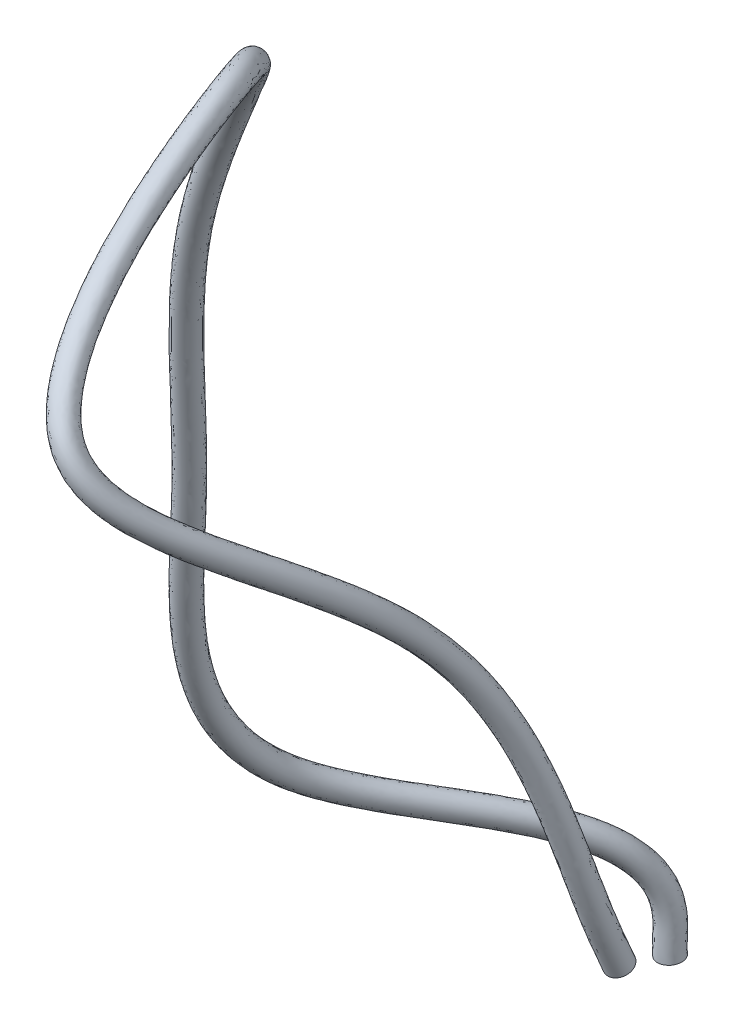
ISO-10303-21;
HEADER;
FILE_DESCRIPTION(('STEP AP214'),'2;1');
FILE_NAME('part.step','',(''),(''),'','','');
FILE_SCHEMA(('AUTOMOTIVE_DESIGN { 1 0 10303 214 1 1 1 1 }'));
ENDSEC;
DATA;
#1=APPLICATION_CONTEXT('core data for automotive mechanical design processes');
#2=APPLICATION_PROTOCOL_DEFINITION('international standard','automotive_design',2000,#1);
#3=PRODUCT_CONTEXT('',#1,'mechanical');
#4=PRODUCT('Part','Part','',(#3));
#5=PRODUCT_RELATED_PRODUCT_CATEGORY('part','',(#4));
#6=PRODUCT_DEFINITION_FORMATION('','',#4);
#7=PRODUCT_DEFINITION_CONTEXT('part definition',#1,'design');
#8=PRODUCT_DEFINITION('design','',#6,#7);
#9=PRODUCT_DEFINITION_SHAPE('','',#8);
#10=(LENGTH_UNIT() NAMED_UNIT(*) SI_UNIT(.MILLI.,.METRE.));
#11=(NAMED_UNIT(*) PLANE_ANGLE_UNIT() SI_UNIT($,.RADIAN.));
#12=(NAMED_UNIT(*) SI_UNIT($,.STERADIAN.) SOLID_ANGLE_UNIT());
#13=UNCERTAINTY_MEASURE_WITH_UNIT(LENGTH_MEASURE(1.E-05),#10,'distance_accuracy_value','');
#14=(GEOMETRIC_REPRESENTATION_CONTEXT(3) GLOBAL_UNCERTAINTY_ASSIGNED_CONTEXT((#13)) GLOBAL_UNIT_ASSIGNED_CONTEXT((#10,
#11,#12)) REPRESENTATION_CONTEXT('',''));
#15=CARTESIAN_POINT('',(0.,0.,0.));
#16=DIRECTION('',(0.,0.,1.));
#17=DIRECTION('',(1.,0.,0.));
#18=AXIS2_PLACEMENT_3D('',#15,#16,#17);
#19=CARTESIAN_POINT('',(1.75,4.81801421890762,-4.75));
#20=DIRECTION('',(-0.0325020887268541,0.998426582921054,0.0456943404042556));
#21=DIRECTION('',(0.,-0.045718494968868,0.99895436293045));
#22=AXIS2_PLACEMENT_3D('',#19,#20,#21);
#23=PLANE('',#22);
#24=CARTESIAN_POINT('',(1.75,4.81801421890762,-4.75));
#25=DIRECTION('',(-0.0325020887268541,0.998426582921054,0.0456943404042556));
#26=DIRECTION('',(0.,-0.045718494968868,0.99895436293045));
#27=AXIS2_PLACEMENT_3D('',#24,#25,#26);
#28=CIRCLE('',#27,0.375);
#29=CARTESIAN_POINT('',(1.75,4.80086978329429,-4.37539211390108));
#30=VERTEX_POINT('',#29);
#31=EDGE_CURVE('E46',#30,#30,#28,.T.);
#32=ORIENTED_EDGE('',*,*,#31,.F.);
#33=EDGE_LOOP('',(#32));
#34=FACE_BOUND('',#33,.T.);
#35=ADVANCED_FACE('F39',(#34),#23,.F.);
#36=CARTESIAN_POINT('',(14.45,18.0575045512539,9.49942929571113));
#37=DIRECTION('',(0.00593618221666124,-0.922706611834414,-0.385457222292886));
#38=DIRECTION('',(-0.944224740760021,0.121743546679703,-0.305970828312954));
#39=AXIS2_PLACEMENT_3D('',#36,#37,#38);
#40=PLANE('',#39);
#41=CARTESIAN_POINT('',(14.45,18.0575045512539,9.49942929571113));
#42=DIRECTION('',(0.00593618221666124,-0.922706611834414,-0.385457222292886));
#43=DIRECTION('',(-0.944224740760021,0.121743546679703,-0.305970828312954));
#44=AXIS2_PLACEMENT_3D('',#41,#42,#43);
#45=CIRCLE('',#44,0.375);
#46=CARTESIAN_POINT('',(14.095915722215,18.1031583812588,9.38469023509377));
#47=VERTEX_POINT('',#46);
#48=EDGE_CURVE('E12',#47,#47,#45,.T.);
#49=ORIENTED_EDGE('',*,*,#48,.T.);
#50=EDGE_LOOP('',(#49));
#51=FACE_BOUND('',#50,.T.);
#52=ADVANCED_FACE('F53',(#51),#40,.T.);
#53=CARTESIAN_POINT('',(1.75,4.80086978329429,-4.37539211390108));
#54=CARTESIAN_POINT('',(1.73834549138408,5.15888477657701,-4.35900716435525));
#55=CARTESIAN_POINT('',(1.75858560857531,5.51339195407523,-4.38854768858719));
#56=CARTESIAN_POINT('',(1.74031176664539,6.16025100675149,-4.35894673934592));
#57=CARTESIAN_POINT('',(1.6878111012617,6.46481684548407,-4.28283425630049));
#58=CARTESIAN_POINT('',(1.51459229823426,7.01539495219556,-4.0301336434056));
#59=CARTESIAN_POINT('',(1.39248305121336,7.26200733868386,-3.85164046028846));
#60=CARTESIAN_POINT('',(0.935927077086803,7.94369272802451,-3.17282927306072));
#61=CARTESIAN_POINT('',(0.522242189846164,8.32292801140119,-2.52508126861568));
#62=CARTESIAN_POINT('',(-0.427874231001778,8.97406507712691,-1.07153849457391));
#63=CARTESIAN_POINT('',(-0.940339246713123,9.26528804569354,-0.261981524505833));
#64=CARTESIAN_POINT('',(-1.87106404941776,9.93667117577498,1.31751262818178));
#65=CARTESIAN_POINT('',(-2.29026422925484,10.3161228840242,2.08830559018309));
#66=CARTESIAN_POINT('',(-2.86564913549272,11.349607496572,3.39521388898401));
#67=CARTESIAN_POINT('',(-3.01375331122337,11.9950088881717,3.91565164964581));
#68=CARTESIAN_POINT('',(-3.1123987189796,13.444399837937,4.75125041499851));
#69=CARTESIAN_POINT('',(-3.0638995121567,14.2481789852778,5.0676585370757));
#70=CARTESIAN_POINT('',(-2.75414927828088,16.777189774041,5.82754846007048));
#71=CARTESIAN_POINT('',(-2.32893654328877,18.6235112799891,6.08366366957657));
#72=CARTESIAN_POINT('',(-1.36117551425449,23.7297998263982,6.94382870020401));
#73=CARTESIAN_POINT('',(-1.11285174562104,26.6047510072162,7.64115992546083));
#74=CARTESIAN_POINT('',(0.438450670251853,30.7242292579583,8.33100387890877));
#75=CARTESIAN_POINT('',(0.808789455132816,31.569006402865,8.4591098466644));
#76=CARTESIAN_POINT('',(1.41231139758344,32.7884491422252,8.69732595118506));
#77=CARTESIAN_POINT('',(1.62409724059286,33.1858047161594,8.78305994849925));
#78=CARTESIAN_POINT('',(2.04420088839937,33.9561428932773,8.98550560214589));
#79=CARTESIAN_POINT('',(2.24353095760551,34.3333071091578,9.10615816499072));
#80=CARTESIAN_POINT('',(3.2757019866038,36.0997636126222,9.77386393543771));
#81=CARTESIAN_POINT('',(4.13427932199285,37.1302826934259,10.5431744798521));
#82=CARTESIAN_POINT('',(5.15645090556548,37.6539821305996,12.5383843190243));
#83=CARTESIAN_POINT('',(5.47630747135298,37.6570117499277,13.3749309830197));
#84=CARTESIAN_POINT('',(6.0634821269365,37.3969355964973,15.1506546846571));
#85=CARTESIAN_POINT('',(6.33448351297503,37.1334647303206,16.0874646469906));
#86=CARTESIAN_POINT('',(6.72970925536736,36.6103867468468,17.3812349798625));
#87=CARTESIAN_POINT('',(6.88051873540548,36.3982544643589,17.7800325761336));
#88=CARTESIAN_POINT('',(7.17906251406527,35.9578932094573,18.5098606446392));
#89=CARTESIAN_POINT('',(7.3261858172549,35.7280677072766,18.8414166413553));
#90=CARTESIAN_POINT('',(7.61590480013183,35.2616509056494,19.4078116856756));
#91=CARTESIAN_POINT('',(7.75870697580675,35.024896802708,19.6423049208884));
#92=CARTESIAN_POINT('',(8.04104397657202,34.561825614751,19.9858224526322));
#93=CARTESIAN_POINT('',(8.18290155789786,34.337749477255,20.0914225987345));
#94=CARTESIAN_POINT('',(8.45411559625873,33.9104124897418,20.1772657370438));
#95=CARTESIAN_POINT('',(8.59040230580956,33.6970906395082,20.160453975484));
#96=CARTESIAN_POINT('',(8.89050770657762,33.2554982777256,20.0032667606929));
#97=CARTESIAN_POINT('',(9.05089167530404,33.0272924510392,19.8643015403344));
#98=CARTESIAN_POINT('',(9.38453762228349,32.5563582097448,19.4847295774971));
#99=CARTESIAN_POINT('',(9.55696746733923,32.3118930686953,19.2459644525602));
#100=CARTESIAN_POINT('',(9.90897735628309,31.8122908696394,18.6934603306158));
#101=CARTESIAN_POINT('',(10.0909205670718,31.5711923208564,18.3705862124573));
#102=CARTESIAN_POINT('',(10.9957507172166,30.3238559038544,16.6533154564681));
#103=CARTESIAN_POINT('',(11.7172223938786,29.2456263963971,14.9138093353947));
#104=CARTESIAN_POINT('',(12.889048167489,26.6696817675826,12.4954979721769));
#105=CARTESIAN_POINT('',(13.3329864039256,25.1851913983253,11.8312548253258));
#106=CARTESIAN_POINT('',(13.9313772897972,22.1137250047152,10.7880573121151));
#107=CARTESIAN_POINT('',(14.0862370525055,20.5261636555709,10.408410805582));
#108=CARTESIAN_POINT('',(14.0978514561569,18.7208456530311,9.65424607352064));
#109=CARTESIAN_POINT('',(14.0938988475559,18.4166580777889,9.51565357246579));
#110=CARTESIAN_POINT('',(14.095915722215,18.1031583812588,9.38469023509377));
#111=CARTESIAN_POINT('',(2.49960375065995,4.82522086079782,-4.37427765396613));
#112=CARTESIAN_POINT('',(2.48958168064563,5.13308845116291,-4.36018773246546));
#113=CARTESIAN_POINT('',(2.5098262462525,5.48746576714886,-4.38818794527609));
#114=CARTESIAN_POINT('',(2.48786811662565,6.24754411313543,-4.35897535980839));
#115=CARTESIAN_POINT('',(2.42363295211408,6.62291627208122,-4.26967766866073));
#116=CARTESIAN_POINT('',(2.21381900883518,7.28830180554111,-3.9735104852677));
#117=CARTESIAN_POINT('',(2.06882693747337,7.5779545902464,-3.76741279942696));
#118=CARTESIAN_POINT('',(1.55165041386711,8.35500734836433,-3.02573360127776));
#119=CARTESIAN_POINT('',(1.09470464665935,8.78550851875668,-2.37983758826014));
#120=CARTESIAN_POINT('',(0.12716820036718,9.44856489678505,-0.899586355522227));
#121=CARTESIAN_POINT('',(-0.381320934595311,9.73769673972982,-0.0953162537282782));
#122=CARTESIAN_POINT('',(-1.28266117608732,10.3878661437688,1.43436261037851));
#123=CARTESIAN_POINT('',(-1.6738192531608,10.7505135580172,2.15819025562766));
#124=CARTESIAN_POINT('',(-2.18047431816676,11.6605482151909,3.30898821486494));
#125=CARTESIAN_POINT('',(-2.31085108483329,12.2232754390501,3.76453942806547));
#126=CARTESIAN_POINT('',(-2.39999544217223,13.5330843974665,4.51967173489684));
#127=CARTESIAN_POINT('',(-2.35671797352169,14.2805032325739,4.81654039226922));
#128=CARTESIAN_POINT('',(-2.06142338979586,16.6914818004579,5.54096754098554));
#129=CARTESIAN_POINT('',(-1.6434100167228,18.5158068039606,5.79803592799711));
#130=CARTESIAN_POINT('',(-0.661814868222379,23.6950894486873,6.67049704446592));
#131=CARTESIAN_POINT('',(-0.415674486029402,26.5142668205417,7.35575511955627));
#132=CARTESIAN_POINT('',(1.08562715233581,30.5009684518852,8.02336419105076));
#133=CARTESIAN_POINT('',(1.44801476255515,31.3286641804852,8.14876957452709));
#134=CARTESIAN_POINT('',(2.0426239542797,32.5301342487947,8.38343805359596));
#135=CARTESIAN_POINT('',(2.25021845081019,32.9253131573554,8.46258947277557));
#136=CARTESIAN_POINT('',(2.67103572955663,33.6823470088806,8.67777383228151));
#137=CARTESIAN_POINT('',(2.87924674100519,34.0390847951178,8.83667188460228));
#138=CARTESIAN_POINT('',(3.91992977622627,35.7277314024304,9.62470118145833));
#139=CARTESIAN_POINT('',(4.73927123356765,36.7122267806372,10.3876969789716));
#140=CARTESIAN_POINT('',(5.71619293028597,37.1951428073189,12.3402173578361));
#141=CARTESIAN_POINT('',(6.03140505396058,37.2041035046301,13.1516244228652));
#142=CARTESIAN_POINT('',(6.60301693882508,36.9508956284323,14.8803297723427));
#143=CARTESIAN_POINT('',(6.8664637011703,36.6939081176874,15.7911201703569));
#144=CARTESIAN_POINT('',(7.24565867992527,36.1919816501446,17.0324992455365));
#145=CARTESIAN_POINT('',(7.43022480524217,36.033200668577,17.4190023122326));
#146=CARTESIAN_POINT('',(7.77375604801927,35.696653986286,18.1305486895265));
#147=CARTESIAN_POINT('',(7.93412201419192,35.5162527248916,18.4533261037024));
#148=CARTESIAN_POINT('',(8.23242360592227,35.1472490636667,18.9932238756729));
#149=CARTESIAN_POINT('',(8.37097186185452,34.9586499324299,19.2093963055398));
#150=CARTESIAN_POINT('',(8.62117381114383,34.6125807725026,19.5088108313218));
#151=CARTESIAN_POINT('',(8.73814640868383,34.4639344612504,19.5933179285066));
#152=CARTESIAN_POINT('',(8.91001447454552,34.2058162252255,19.6507478861622));
#153=CARTESIAN_POINT('',(8.98457496712406,34.0682241103523,19.6359765437764));
#154=CARTESIAN_POINT('',(9.1935722709824,33.7417472812802,19.5134683208225));
#155=CARTESIAN_POINT('',(9.31886763047689,33.5518154118425,19.3979120401489));
#156=CARTESIAN_POINT('',(9.59002387353872,33.1343009144822,19.0508952191962));
#157=CARTESIAN_POINT('',(9.73007408299289,32.9052634559361,18.8199129511807));
#158=CARTESIAN_POINT('',(10.0202059300517,32.4257865554955,18.2753389932568));
#159=CARTESIAN_POINT('',(10.2035454845704,32.1931947274641,17.9668547151246));
#160=CARTESIAN_POINT('',(11.0919257167998,30.9685536649685,16.2808332769359));
#161=CARTESIAN_POINT('',(11.8277277367021,29.8832549451992,14.5085682643998));
#162=CARTESIAN_POINT('',(13.0897017835891,27.1091435534739,11.9042168340906));
#163=CARTESIAN_POINT('',(13.5648017409014,25.5091760158557,11.1931797539448));
#164=CARTESIAN_POINT('',(14.184165519775,22.3300126895067,10.1134004145704));
#165=CARTESIAN_POINT('',(14.333533382384,20.7445291687749,9.73214172261608));
#166=CARTESIAN_POINT('',(14.3447156022644,19.0063696403354,9.00603214258174));
#167=CARTESIAN_POINT('',(14.3407629720064,18.7021887639698,8.86744244970796));
#168=CARTESIAN_POINT('',(14.342851898951,18.3774892895463,8.73180044548369));
#169=CARTESIAN_POINT('',(2.49960375065995,4.85950973202447,-5.12349342616397));
#170=CARTESIAN_POINT('',(2.49188032541787,5.09676451929101,-5.11263514486812));
#171=CARTESIAN_POINT('',(2.51366551141307,5.45129322452986,-5.1406309817678));
#172=CARTESIAN_POINT('',(2.48098148044587,6.36984187780238,-5.10415886403395));
#173=CARTESIAN_POINT('',(2.39699804916521,6.84324636959158,-4.9917020098388));
#174=CARTESIAN_POINT('',(2.12856630384508,7.66271260125245,-4.62398912518641));
#175=CARTESIAN_POINT('',(1.94748691268253,8.00721351231051,-4.37331500869631));
#176=CARTESIAN_POINT('',(1.33129600772602,8.88666312590052,-3.52141751196474));
#177=CARTESIAN_POINT('',(0.798690518376807,9.29793731065101,-2.84158723561957));
#178=CARTESIAN_POINT('',(-0.199894042268834,9.98232651684688,-1.31377132783138));
#179=CARTESIAN_POINT('',(-0.711704649750672,10.2733757580499,-0.503395160719085));
#180=CARTESIAN_POINT('',(-1.60198511101425,10.9156147422279,1.00757525664493));
#181=CARTESIAN_POINT('',(-1.9768811848424,11.2698312107893,1.70487687493048));
#182=CARTESIAN_POINT('',(-2.43959483150953,12.100940116917,2.75586805602193));
#183=CARTESIAN_POINT('',(-2.5584532953384,12.6104355502502,3.16949368831804));
#184=CARTESIAN_POINT('',(-2.64138747950759,13.8290597545069,3.87205478605546));
#185=CARTESIAN_POINT('',(-2.60149899866946,14.5389464666231,4.15578356521213));
#186=CARTESIAN_POINT('',(-2.31615068199942,16.8686996889342,4.85580421142094));
#187=CARTESIAN_POINT('',(-1.90389201472481,18.673869522539,5.11268334440079));
#188=CARTESIAN_POINT('',(-0.918688767327438,23.87218951692,5.98835131357423));
#189=CARTESIAN_POINT('',(-0.669618612457239,26.7107421088123,6.6778560382282));
#190=CARTESIAN_POINT('',(0.836782805144546,30.7109868222507,7.34773311003772));
#191=CARTESIAN_POINT('',(1.204195419592,31.5516733172862,7.47498370789622));
#192=CARTESIAN_POINT('',(1.81571487671765,32.7873905701486,7.71635594414231));
#193=CARTESIAN_POINT('',(2.02528912355949,33.1987884079309,7.80109305685726));
#194=CARTESIAN_POINT('',(2.47866170836001,33.9836523102492,8.0181021164007));
#195=CARTESIAN_POINT('',(2.73542375386855,34.3436380066989,8.16535735132199));
#196=CARTESIAN_POINT('',(3.96828567454568,36.087722024543,8.9492879216604));
#197=CARTESIAN_POINT('',(4.9411775457239,37.2433595762101,9.82431685715699));
#198=CARTESIAN_POINT('',(6.13130875459376,37.7993763692154,12.1292149815993));
#199=CARTESIAN_POINT('',(6.46790781627734,37.8044825634863,13.0262638929823));
#200=CARTESIAN_POINT('',(7.07986586985425,37.5333974917896,14.8769214856382));
#201=CARTESIAN_POINT('',(7.35490526356218,37.2631174562287,15.8287564801887));
#202=CARTESIAN_POINT('',(7.74991110713313,36.7402798154357,17.121781620132));
#203=CARTESIAN_POINT('',(7.89759059298068,36.6072883841802,17.5516167498972));
#204=CARTESIAN_POINT('',(8.17487162636393,36.2939611826082,18.349465298971));
#205=CARTESIAN_POINT('',(8.3070960084485,36.114182897805,18.7141618040481));
#206=CARTESIAN_POINT('',(8.56895867617162,35.7244226990966,19.3371426106156));
#207=CARTESIAN_POINT('',(8.69879659377711,35.5147696436872,19.5951706487832));
#208=CARTESIAN_POINT('',(8.95831785620206,35.0952034315911,19.9767523738911));
#209=CARTESIAN_POINT('',(9.08867458573647,34.8896320773379,20.1084194056432));
#210=CARTESIAN_POINT('',(9.3419347377375,34.4905369178248,20.2001088391007));
#211=CARTESIAN_POINT('',(9.47064267894971,34.2890149135599,20.166546544829));
#212=CARTESIAN_POINT('',(9.75445801554693,33.8709667281535,19.9984677585533));
#213=CARTESIAN_POINT('',(9.90729341131337,33.6532640276824,19.8533113501866));
#214=CARTESIAN_POINT('',(10.2213263395942,33.2075315187964,19.4509198822737));
#215=CARTESIAN_POINT('',(10.3783774712971,32.9815203396157,19.1904798120718));
#216=CARTESIAN_POINT('',(10.693728933547,32.5196056883879,18.5931391409658));
#217=CARTESIAN_POINT('',(10.8805608523785,32.273472816962,18.2796161583374));
#218=CARTESIAN_POINT('',(11.7898839742478,31.0199469777838,16.5538508666311));
#219=CARTESIAN_POINT('',(12.527094868516,29.9286871263288,14.7760473998105));
#220=CARTESIAN_POINT('',(13.7796553663595,27.1752688768222,12.1911228312563));
#221=CARTESIAN_POINT('',(14.2567646298909,25.5755061075798,11.4759268470631));
#222=CARTESIAN_POINT('',(14.885440184337,22.3485659877513,10.3799109381322));
#223=CARTESIAN_POINT('',(15.0412962719985,20.716271548023,9.98795886934447));
#224=CARTESIAN_POINT('',(15.0529652910256,18.902451972474,9.23024245871773));
#225=CARTESIAN_POINT('',(15.049012695619,18.598264376605,9.09164997856012));
#226=CARTESIAN_POINT('',(15.051020454521,18.2861816295366,8.96127856671841));
#227=CARTESIAN_POINT('',(1.75,4.83515865452094,-5.12460788609892));
#228=CARTESIAN_POINT('',(1.74064413615624,5.12256084470512,-5.11145457675819));
#229=CARTESIAN_POINT('',(1.76242487373594,5.4772194114563,-5.1409907250789));
#230=CARTESIAN_POINT('',(1.73342513046555,6.28254877141836,-5.10413024357148));
#231=CARTESIAN_POINT('',(1.6611761983128,6.68514694299451,-5.00485859747841));
#232=CARTESIAN_POINT('',(1.4293395932442,7.38980574790682,-4.68061228332446));
#233=CARTESIAN_POINT('',(1.27114302642249,7.69126626074789,-4.45754266955765));
#234=CARTESIAN_POINT('',(0.715572670945752,8.47534850556087,-3.66851318374804));
#235=CARTESIAN_POINT('',(0.226228061563723,8.83535680329512,-2.98683091597491));
#236=CARTESIAN_POINT('',(-0.754936473637894,9.50782669718915,-1.48572346688327));
#237=CARTESIAN_POINT('',(-1.27072296186869,9.80096706401366,-0.670060431496429));
#238=CARTESIAN_POINT('',(-2.19038798434448,10.464419774234,0.890725274447984));
#239=CARTESIAN_POINT('',(-2.59332616093653,10.8354405367966,1.63499220948591));
#240=CARTESIAN_POINT('',(-3.1247696488354,11.7899993982977,2.842093730141));
#241=CARTESIAN_POINT('',(-3.26135552172848,12.3821689993714,3.32060590989838));
#242=CARTESIAN_POINT('',(-3.35379075631496,13.7403751949777,4.10363346615714));
#243=CARTESIAN_POINT('',(-3.30868053730429,14.5066222193271,4.4069017100188));
#244=CARTESIAN_POINT('',(-3.00887657048483,16.9544076625173,5.1423851305055));
#245=CARTESIAN_POINT('',(-2.58941854129078,18.7815739985675,5.39831108597988));
#246=CARTESIAN_POINT('',(-1.61804941335955,23.9068998946309,6.26168296931308));
#247=CARTESIAN_POINT('',(-1.36679587204965,26.8012262954868,6.96326084413353));
#248=CARTESIAN_POINT('',(0.189606323060786,30.9342476283238,7.65537279789553));
#249=CARTESIAN_POINT('',(0.564970112169572,31.792015539666,7.78532398003332));
#250=CARTESIAN_POINT('',(1.18540232002144,33.0457054635791,8.03024384173151));
#251=CARTESIAN_POINT('',(1.39916791334206,33.4592799667341,8.12156353258075));
#252=CARTESIAN_POINT('',(1.85182686720285,34.2574481946466,8.32583388626528));
#253=CARTESIAN_POINT('',(2.09970797046897,34.6378603207389,8.43484363171023));
#254=CARTESIAN_POINT('',(3.32405788492283,36.4597542347347,9.09845067564055));
#255=CARTESIAN_POINT('',(4.33618563414909,37.6614154890016,9.9797943580367));
#256=CARTESIAN_POINT('',(5.57156672987326,38.2582156924947,12.3273819427879));
#257=CARTESIAN_POINT('',(5.91281023366996,38.2573908087838,13.2495704531363));
#258=CARTESIAN_POINT('',(6.54033105796545,37.9794374598547,15.147246397953));
#259=CARTESIAN_POINT('',(6.82292507536713,37.7026740688636,16.1251009568207));
#260=CARTESIAN_POINT('',(7.23396168257512,37.1586849121371,17.4705173544589));
#261=CARTESIAN_POINT('',(7.34788452314379,36.9723421799622,17.9126470137986));
#262=CARTESIAN_POINT('',(7.58017809241013,36.5552004057794,18.7287772540834));
#263=CARTESIAN_POINT('',(7.69915981151139,36.3259978801907,19.1022523417006));
#264=CARTESIAN_POINT('',(7.95243987038127,35.8388245410785,19.7517304206187));
#265=CARTESIAN_POINT('',(8.08653170772927,35.5810165139654,20.0280792641325));
#266=CARTESIAN_POINT('',(8.37818802163032,35.0444482738394,20.4537639952009));
#267=CARTESIAN_POINT('',(8.53342973495076,34.7634470933419,20.6065240758713));
#268=CARTESIAN_POINT('',(8.88603585945045,34.1951331823416,20.7266266899821));
#269=CARTESIAN_POINT('',(9.07647001763547,33.9178814427164,20.6910239765366));
#270=CARTESIAN_POINT('',(9.45139345114187,33.3847177245984,20.4882661984237));
#271=CARTESIAN_POINT('',(9.63931745614084,33.1287410668797,20.3197008503721));
#272=CARTESIAN_POINT('',(10.0158400883387,32.6295888140584,19.8847542405746));
#273=CARTESIAN_POINT('',(10.2052708556431,32.3881499523756,19.6165313134509));
#274=CARTESIAN_POINT('',(10.5825003597788,31.906110002531,19.0112604783252));
#275=CARTESIAN_POINT('',(10.76793593488,31.6514704103547,18.6833476556696));
#276=CARTESIAN_POINT('',(11.6937089746646,30.375249216668,16.9263330461649));
#277=CARTESIAN_POINT('',(12.4165895256924,29.2910585775299,15.1812884708053));
#278=CARTESIAN_POINT('',(13.5790017502594,26.7358070909278,12.7824039693426));
#279=CARTESIAN_POINT('',(14.0249492929144,25.2515214900479,12.1140019184441));
#280=CARTESIAN_POINT('',(14.6326519543599,22.1322783029612,11.0545678356769));
#281=CARTESIAN_POINT('',(14.79399994212,20.497906034819,10.6642279523097));
#282=CARTESIAN_POINT('',(14.806101144918,18.6169279851697,9.87845638965678));
#283=CARTESIAN_POINT('',(14.8021485711684,18.312733690425,9.73986110131852));
#284=CARTESIAN_POINT('',(14.804084277785,18.011850721249,9.61416835632849));
#285=CARTESIAN_POINT('',(1.00039624934005,4.81080757701741,-5.12572234603387));
#286=CARTESIAN_POINT('',(0.989407946894615,5.14835717011923,-5.11027400864826));
#287=CARTESIAN_POINT('',(1.01118423605881,5.50314559838274,-5.14135046838999));
#288=CARTESIAN_POINT('',(0.985868780485223,6.19525566503434,-5.10410162310901));
#289=CARTESIAN_POINT('',(0.925354347460384,6.52704751639745,-5.01801518511802));
#290=CARTESIAN_POINT('',(0.730112882643324,7.11689889456119,-4.73723544146251));
#291=CARTESIAN_POINT('',(0.594799140162457,7.37531900918526,-4.54177033041898));
#292=CARTESIAN_POINT('',(0.0998493341654819,8.06403388522122,-3.81560885553133));
#293=CARTESIAN_POINT('',(-0.346234395249362,8.37277629593923,-3.13207459633024));
#294=CARTESIAN_POINT('',(-1.30997890500695,9.03332687753143,-1.65767560593516));
#295=CARTESIAN_POINT('',(-1.82974127398672,9.32855836997738,-0.836725702273772));
#296=CARTESIAN_POINT('',(-2.77879085767471,10.0132248062402,0.773875292251042));
#297=CARTESIAN_POINT('',(-3.20977113703066,10.401049862804,1.56510754404133));
#298=CARTESIAN_POINT('',(-3.80994446616126,11.4790586796785,2.92831940426006));
#299=CARTESIAN_POINT('',(-3.96425774811856,12.1539024484927,3.47171813147871));
#300=CARTESIAN_POINT('',(-4.06619403312233,13.6516906354486,4.33521214625881));
#301=CARTESIAN_POINT('',(-4.01586207593911,14.474297972031,4.65801985482547));
#302=CARTESIAN_POINT('',(-3.70160245897023,17.0401156361004,5.42896604959005));
#303=CARTESIAN_POINT('',(-3.27494506785675,18.889278474596,5.68393882755896));
#304=CARTESIAN_POINT('',(-2.31741005939167,23.9416102723418,6.53501462505194));
#305=CARTESIAN_POINT('',(-2.06397313164206,26.8917104821613,7.24866565003886));
#306=CARTESIAN_POINT('',(-0.457570159022975,31.1575084343968,7.96301248575335));
#307=CARTESIAN_POINT('',(-0.0742551952528605,32.0323577620459,8.09566425217042));
#308=CARTESIAN_POINT('',(0.555089763325225,33.3040203570096,8.34413173932071));
#309=CARTESIAN_POINT('',(0.77304670312463,33.7197715255373,8.44203400830423));
#310=CARTESIAN_POINT('',(1.22499202604569,34.531244079044,8.63356565612985));
#311=CARTESIAN_POINT('',(1.46399218706939,34.932082634779,8.70432991209847));
#312=CARTESIAN_POINT('',(2.67983009529997,36.8317864449265,9.24761342962071));
#313=CARTESIAN_POINT('',(3.73119372257429,38.0794714017932,10.1352718589164));
#314=CARTESIAN_POINT('',(5.01182470515277,38.7170550157739,12.5255489039764));
#315=CARTESIAN_POINT('',(5.35771265106258,38.7102990540814,13.4728770132903));
#316=CARTESIAN_POINT('',(6.00079624607665,38.4254774279197,15.4175713102679));
#317=CARTESIAN_POINT('',(6.29094488717208,38.1422306814985,16.4214454334527));
#318=CARTESIAN_POINT('',(6.7180122580171,37.5770900088385,17.8192530887857));
#319=CARTESIAN_POINT('',(6.7981784533069,37.3373959757441,18.2736772777));
#320=CARTESIAN_POINT('',(6.98548455845633,36.8164396289507,19.1080892091958));
#321=CARTESIAN_POINT('',(7.09122361457428,36.5378128625764,19.4903428793531));
#322=CARTESIAN_POINT('',(7.33592106459091,35.9532263830605,20.1663182306218));
#323=CARTESIAN_POINT('',(7.47426682168142,35.6472633842435,20.4609878794818));
#324=CARTESIAN_POINT('',(7.79805818705858,34.9936931160878,20.9307756165106));
#325=CARTESIAN_POINT('',(7.97818488416505,34.637262109346,21.1046287460995));
#326=CARTESIAN_POINT('',(8.4301369811634,33.8997294468584,21.2531445408634));
#327=CARTESIAN_POINT('',(8.68229735632123,33.5467479718728,21.2155014082442));
#328=CARTESIAN_POINT('',(9.14832888673681,32.8984687210433,20.9780646382941));
#329=CARTESIAN_POINT('',(9.3713415009683,32.6042181060769,20.7860903505575));
#330=CARTESIAN_POINT('',(9.81035383708314,32.0516461093203,20.3185885988755));
#331=CARTESIAN_POINT('',(10.0321642399891,31.7947795651356,20.0425828148301));
#332=CARTESIAN_POINT('',(10.4712717860105,31.2926143166741,19.4293818156846));
#333=CARTESIAN_POINT('',(10.6553110173815,31.0294680037474,19.0870791530019));
#334=CARTESIAN_POINT('',(11.5975339750814,29.7305514555523,17.2988152256988));
#335=CARTESIAN_POINT('',(12.3060841828689,28.6534300287311,15.5865295418002));
#336=CARTESIAN_POINT('',(13.3783481341594,26.2963453050333,13.3736851074288));
#337=CARTESIAN_POINT('',(13.7931339559379,24.9275368725161,12.7520769898251));
#338=CARTESIAN_POINT('',(14.3798637243828,21.9159906181711,11.7292247332216));
#339=CARTESIAN_POINT('',(14.5467036122415,20.279540521615,11.340497035275));
#340=CARTESIAN_POINT('',(14.5592369988104,18.3314039978655,10.5266703205958));
#341=CARTESIAN_POINT('',(14.5552844467179,18.027203004245,10.3880722240769));
#342=CARTESIAN_POINT('',(14.557148101049,17.7375198129614,10.2670581459386));
#343=CARTESIAN_POINT('',(1.00039624934005,4.77651870579076,-4.37650657383603));
#344=CARTESIAN_POINT('',(0.987109302122521,5.18468110199112,-4.35782659624504));
#345=CARTESIAN_POINT('',(1.00734497089813,5.5393181410016,-4.38890743189829));
#346=CARTESIAN_POINT('',(0.992755416665135,6.07295790036756,-4.35891811888345));
#347=CARTESIAN_POINT('',(0.951989250409329,6.30671741888692,-4.29599084394026));
#348=CARTESIAN_POINT('',(0.815365587633348,6.74248809885,-4.08675680154349));
#349=CARTESIAN_POINT('',(0.716139164953342,6.94606008712132,-3.93586812114996));
#350=CARTESIAN_POINT('',(0.320203740306491,7.53237810768469,-3.31992494484368));
#351=CARTESIAN_POINT('',(-0.0502202669670231,7.86034750404572,-2.67032494897122));
#352=CARTESIAN_POINT('',(-0.982916662370736,8.49956525746877,-1.2434906336256));
#353=CARTESIAN_POINT('',(-1.49935755883093,8.79287935165726,-0.428646795283386));
#354=CARTESIAN_POINT('',(-2.45946692274819,9.48547620778113,1.20066264598505));
#355=CARTESIAN_POINT('',(-2.90670920534887,9.88173221003117,2.01842092473852));
#356=CARTESIAN_POINT('',(-3.55082395281868,11.0386667779531,3.48143956310308));
#357=CARTESIAN_POINT('',(-3.71665553761345,11.7667423372933,4.06676387122615));
#358=CARTESIAN_POINT('',(-3.82480199578697,13.3557152784074,4.98282909510019));
#359=CARTESIAN_POINT('',(-3.77108105079171,14.2158547379818,5.31877668188218));
#360=CARTESIAN_POINT('',(-3.4468751667659,16.8628977476241,6.11412937915541));
#361=CARTESIAN_POINT('',(-3.01446306985474,18.7312157560176,6.36929141115604));
#362=CARTESIAN_POINT('',(-2.06053616028661,23.7645102041091,7.21716035594211));
#363=CARTESIAN_POINT('',(-1.81002900521267,26.6952351938907,7.92656473136539));
#364=CARTESIAN_POINT('',(-0.208725811832101,30.9474900640314,8.63864356676677));
#365=CARTESIAN_POINT('',(0.169564147710485,31.8093486252449,8.7694501188017));
#366=CARTESIAN_POINT('',(0.781998840887175,33.0467640356557,9.01121384877416));
#367=CARTESIAN_POINT('',(0.997976030375526,33.4462962749635,9.10353042422293));
#368=CARTESIAN_POINT('',(1.41736604724211,34.2299387776739,9.29323737201027));
#369=CARTESIAN_POINT('',(1.60781517420584,34.6275294231979,9.37564444537915));
#370=CARTESIAN_POINT('',(2.63147419698133,36.4717958228139,9.9230266894171));
#371=CARTESIAN_POINT('',(3.52928741041805,37.5483386062145,10.6986519807325));
#372=CARTESIAN_POINT('',(4.59670888084498,38.1128214538803,12.7365512802125));
#373=CARTESIAN_POINT('',(4.92120988874539,38.1099199952252,13.5982375431741));
#374=CARTESIAN_POINT('',(5.52394731504791,37.8429755645623,15.4209795969715));
#375=CARTESIAN_POINT('',(5.80250332477977,37.5730213429538,16.3838091236243));
#376=CARTESIAN_POINT('',(6.21375983080946,37.0287918435491,17.7299707141884));
#377=CARTESIAN_POINT('',(6.33081266556879,36.7633082601408,18.1410628400346));
#378=CARTESIAN_POINT('',(6.58436898011127,36.2191324326285,18.889172599752));
#379=CARTESIAN_POINT('',(6.71824962031787,35.9398826896615,19.2295071790081));
#380=CARTESIAN_POINT('',(6.99938599434139,35.3760527476321,19.8223994956784));
#381=CARTESIAN_POINT('',(7.14644208975899,35.0911436729862,20.0752135362371));
#382=CARTESIAN_POINT('',(7.46091414200021,34.5110704569993,20.4628340739425));
#383=CARTESIAN_POINT('',(7.6276567071119,34.2115644932596,20.5895272689623));
#384=CARTESIAN_POINT('',(7.99821671797194,33.615008754258,20.7037835879254));
#385=CARTESIAN_POINT('',(8.19622964449505,33.3259571686641,20.6849314071915));
#386=CARTESIAN_POINT('',(8.58744314217283,32.7692492741711,20.4930652005633));
#387=CARTESIAN_POINT('',(8.78291572013119,32.5027694902358,20.3306910405198));
#388=CARTESIAN_POINT('',(9.17905137102825,31.9784155050074,19.918563935798));
#389=CARTESIAN_POINT('',(9.38386085168557,31.7185226814546,19.6720159539397));
#390=CARTESIAN_POINT('',(9.79774878251448,31.1987951837832,19.1115816679748));
#391=CARTESIAN_POINT('',(9.97829564957333,30.9491899142487,18.77431770979));
#392=CARTESIAN_POINT('',(10.8995757176334,29.6791581427402,17.0257976360003));
#393=CARTESIAN_POINT('',(11.606717051055,28.6079978475951,15.3190504063895));
#394=CARTESIAN_POINT('',(12.688394551389,26.2302199816914,13.0867791102631));
#395=CARTESIAN_POINT('',(13.1011710669499,24.861206780795,12.4693298967067));
#396=CARTESIAN_POINT('',(13.6785890598194,21.8974373199236,11.4627142096599));
#397=CARTESIAN_POINT('',(13.838940722627,20.3077981423669,11.084679888548));
#398=CARTESIAN_POINT('',(13.8509873100493,18.4353216657268,10.3024600044596));
#399=CARTESIAN_POINT('',(13.8470347231053,18.1311273916081,10.1638646952236));
#400=CARTESIAN_POINT('',(13.8489795454789,17.8288274729712,10.0375800247039));
#401=CARTESIAN_POINT('',(1.75,4.80086978329429,-4.37539211390108));
#402=CARTESIAN_POINT('',(1.73834549138408,5.15888477657701,-4.35900716435525));
#403=CARTESIAN_POINT('',(1.75858560857531,5.51339195407523,-4.38854768858719));
#404=CARTESIAN_POINT('',(1.74031176664539,6.16025100675149,-4.35894673934592));
#405=CARTESIAN_POINT('',(1.6878111012617,6.46481684548407,-4.28283425630049));
#406=CARTESIAN_POINT('',(1.51459229823426,7.01539495219556,-4.0301336434056));
#407=CARTESIAN_POINT('',(1.39248305121336,7.26200733868386,-3.85164046028846));
#408=CARTESIAN_POINT('',(0.935927077086803,7.94369272802451,-3.17282927306072));
#409=CARTESIAN_POINT('',(0.522242189846164,8.32292801140119,-2.52508126861568));
#410=CARTESIAN_POINT('',(-0.427874231001778,8.97406507712691,-1.07153849457391));
#411=CARTESIAN_POINT('',(-0.940339246713123,9.26528804569354,-0.261981524505833));
#412=CARTESIAN_POINT('',(-1.87106404941776,9.93667117577498,1.31751262818178));
#413=CARTESIAN_POINT('',(-2.29026422925484,10.3161228840242,2.08830559018309));
#414=CARTESIAN_POINT('',(-2.86564913549272,11.349607496572,3.39521388898401));
#415=CARTESIAN_POINT('',(-3.01375331122337,11.9950088881717,3.91565164964581));
#416=CARTESIAN_POINT('',(-3.1123987189796,13.444399837937,4.75125041499851));
#417=CARTESIAN_POINT('',(-3.0638995121567,14.2481789852778,5.0676585370757));
#418=CARTESIAN_POINT('',(-2.75414927828088,16.777189774041,5.82754846007048));
#419=CARTESIAN_POINT('',(-2.32893654328877,18.6235112799891,6.08366366957657));
#420=CARTESIAN_POINT('',(-1.36117551425449,23.7297998263982,6.94382870020401));
#421=CARTESIAN_POINT('',(-1.11285174562104,26.6047510072162,7.64115992546083));
#422=CARTESIAN_POINT('',(0.438450670251853,30.7242292579583,8.33100387890877));
#423=CARTESIAN_POINT('',(0.808789455132816,31.569006402865,8.4591098466644));
#424=CARTESIAN_POINT('',(1.41231139758344,32.7884491422252,8.69732595118506));
#425=CARTESIAN_POINT('',(1.62409724059286,33.1858047161594,8.78305994849925));
#426=CARTESIAN_POINT('',(2.04420088839937,33.9561428932773,8.98550560214589));
#427=CARTESIAN_POINT('',(2.24353095760551,34.3333071091578,9.10615816499072));
#428=CARTESIAN_POINT('',(3.2757019866038,36.0997636126222,9.77386393543771));
#429=CARTESIAN_POINT('',(4.13427932199285,37.1302826934259,10.5431744798521));
#430=CARTESIAN_POINT('',(5.15645090556548,37.6539821305996,12.5383843190243));
#431=CARTESIAN_POINT('',(5.47630747135298,37.6570117499277,13.3749309830197));
#432=CARTESIAN_POINT('',(6.0634821269365,37.3969355964973,15.1506546846571));
#433=CARTESIAN_POINT('',(6.33448351297503,37.1334647303206,16.0874646469906));
#434=CARTESIAN_POINT('',(6.72970925536736,36.6103867468468,17.3812349798625));
#435=CARTESIAN_POINT('',(6.88051873540548,36.3982544643589,17.7800325761336));
#436=CARTESIAN_POINT('',(7.17906251406527,35.9578932094573,18.5098606446392));
#437=CARTESIAN_POINT('',(7.3261858172549,35.7280677072766,18.8414166413553));
#438=CARTESIAN_POINT('',(7.61590480013183,35.2616509056494,19.4078116856756));
#439=CARTESIAN_POINT('',(7.75870697580675,35.024896802708,19.6423049208884));
#440=CARTESIAN_POINT('',(8.04104397657202,34.561825614751,19.9858224526322));
#441=CARTESIAN_POINT('',(8.18290155789786,34.337749477255,20.0914225987345));
#442=CARTESIAN_POINT('',(8.45411559625873,33.9104124897418,20.1772657370438));
#443=CARTESIAN_POINT('',(8.59040230580956,33.6970906395082,20.160453975484));
#444=CARTESIAN_POINT('',(8.89050770657762,33.2554982777256,20.0032667606929));
#445=CARTESIAN_POINT('',(9.05089167530404,33.0272924510392,19.8643015403344));
#446=CARTESIAN_POINT('',(9.38453762228349,32.5563582097448,19.4847295774971));
#447=CARTESIAN_POINT('',(9.55696746733923,32.3118930686953,19.2459644525602));
#448=CARTESIAN_POINT('',(9.90897735628309,31.8122908696394,18.6934603306158));
#449=CARTESIAN_POINT('',(10.0909205670718,31.5711923208564,18.3705862124573));
#450=CARTESIAN_POINT('',(10.9957507172166,30.3238559038544,16.6533154564681));
#451=CARTESIAN_POINT('',(11.7172223938786,29.2456263963971,14.9138093353947));
#452=CARTESIAN_POINT('',(12.889048167489,26.6696817675826,12.4954979721769));
#453=CARTESIAN_POINT('',(13.3329864039256,25.1851913983253,11.8312548253258));
#454=CARTESIAN_POINT('',(13.9313772897972,22.1137250047152,10.7880573121151));
#455=CARTESIAN_POINT('',(14.0862370525055,20.5261636555709,10.408410805582));
#456=CARTESIAN_POINT('',(14.0978514561569,18.7208456530311,9.65424607352064));
#457=CARTESIAN_POINT('',(14.0938988475559,18.4166580777889,9.51565357246579));
#458=CARTESIAN_POINT('',(14.095915722215,18.1031583812588,9.38469023509377));
#459=(BOUNDED_SURFACE() B_SPLINE_SURFACE(3,3,((#53,#54,#55,#56,#57,#58,#59,#60,#61,#62,#63,#64,
#65,#66,#67,#68,#69,#70,#71,#72,#73,#74,#75,#76,#77,#78,#79,#80,#81,#82,#83,#84,#85,#86,#87,#88,
#89,#90,#91,#92,#93,#94,#95,#96,#97,#98,#99,#100,#101,#102,#103,#104,#105,#106,#107,#108,#109,
#110),(#111,#112,#113,#114,#115,#116,#117,#118,#119,#120,#121,#122,#123,#124,#125,#126,#127,
#128,#129,#130,#131,#132,#133,#134,#135,#136,#137,#138,#139,#140,#141,#142,#143,#144,#145,#146,
#147,#148,#149,#150,#151,#152,#153,#154,#155,#156,#157,#158,#159,#160,#161,#162,#163,#164,#165,
#166,#167,#168),(#169,#170,#171,#172,#173,#174,#175,#176,#177,#178,#179,#180,#181,#182,#183,
#184,#185,#186,#187,#188,#189,#190,#191,#192,#193,#194,#195,#196,#197,#198,#199,#200,#201,#202,
#203,#204,#205,#206,#207,#208,#209,#210,#211,#212,#213,#214,#215,#216,#217,#218,#219,#220,#221,
#222,#223,#224,#225,#226),(#227,#228,#229,#230,#231,#232,#233,#234,#235,#236,#237,#238,#239,
#240,#241,#242,#243,#244,#245,#246,#247,#248,#249,#250,#251,#252,#253,#254,#255,#256,#257,#258,
#259,#260,#261,#262,#263,#264,#265,#266,#267,#268,#269,#270,#271,#272,#273,#274,#275,#276,#277,
#278,#279,#280,#281,#282,#283,#284),(#285,#286,#287,#288,#289,#290,#291,#292,#293,#294,#295,
#296,#297,#298,#299,#300,#301,#302,#303,#304,#305,#306,#307,#308,#309,#310,#311,#312,#313,#314,
#315,#316,#317,#318,#319,#320,#321,#322,#323,#324,#325,#326,#327,#328,#329,#330,#331,#332,#333,
#334,#335,#336,#337,#338,#339,#340,#341,#342),(#343,#344,#345,#346,#347,#348,#349,#350,#351,
#352,#353,#354,#355,#356,#357,#358,#359,#360,#361,#362,#363,#364,#365,#366,#367,#368,#369,#370,
#371,#372,#373,#374,#375,#376,#377,#378,#379,#380,#381,#382,#383,#384,#385,#386,#387,#388,#389,
#390,#391,#392,#393,#394,#395,#396,#397,#398,#399,#400),(#401,#402,#403,#404,#405,#406,#407,
#408,#409,#410,#411,#412,#413,#414,#415,#416,#417,#418,#419,#420,#421,#422,#423,#424,#425,#426,
#427,#428,#429,#430,#431,#432,#433,#434,#435,#436,#437,#438,#439,#440,#441,#442,#443,#444,#445,
#446,#447,#448,#449,#450,#451,#452,#453,#454,#455,#456,#457,#458)),.UNSPECIFIED.,.T.,.F.,
.F.) B_SPLINE_SURFACE_WITH_KNOTS((4,3,4),(4,2,2,2,2,2,2,2,2,2,2,2,2,2,2,2,2,2,2,2,2,2,2,2,2,2,2,
2,4),(0.,0.5,1.),(0.,0.0138888888888888,0.0312499999999999,0.048611111111111,0.0833333333333333,
0.118055555555555,0.152777777777778,0.1875,0.222222222222222,0.291666666666667,
0.430555555555555,0.465277777777785,0.4826388888889,0.500000000000015,0.569444444444476,
0.60416666666669,0.638888888888904,0.656250000000012,0.673611111111119,0.690972222222226,
0.708333333333333,0.725694444444444,0.743055555555555,0.760416666666667,0.777777777777778,
0.847222222222222,0.916666666666667,0.986111111111111,1.),
.UNSPECIFIED.) GEOMETRIC_REPRESENTATION_ITEM() RATIONAL_B_SPLINE_SURFACE(((1.,1.,1.,1.,1.,1.,1.,
1.,1.,1.,1.,1.,1.,1.,1.,1.,1.,1.,1.,1.,1.,1.,1.,1.,1.,1.,1.,1.,1.,1.,1.,1.,1.,1.,1.,1.,1.,1.,1.,
1.,1.,1.,1.,1.,1.,1.,1.,1.,1.,1.,1.,1.,1.,1.,1.,1.,1.,1.),(0.333333333333333,0.333333333333333,
0.333333333333333,0.333333333333333,0.333333333333333,0.333333333333333,0.333333333333333,
0.333333333333333,0.333333333333333,0.333333333333333,0.333333333333333,0.333333333333333,
0.333333333333333,0.333333333333333,0.333333333333333,0.333333333333333,0.333333333333333,
0.333333333333333,0.333333333333333,0.333333333333333,0.333333333333333,0.333333333333333,
0.333333333333333,0.333333333333333,0.333333333333333,0.333333333333333,0.333333333333333,
0.333333333333333,0.333333333333333,0.333333333333333,0.333333333333333,0.333333333333333,
0.333333333333333,0.333333333333333,0.333333333333333,0.333333333333333,0.333333333333333,
0.333333333333333,0.333333333333333,0.333333333333333,0.333333333333333,0.333333333333333,
0.333333333333333,0.333333333333333,0.333333333333333,0.333333333333333,0.333333333333333,
0.333333333333333,0.333333333333333,0.333333333333333,0.333333333333333,0.333333333333333,
0.333333333333333,0.333333333333333,0.333333333333333,0.333333333333333,0.333333333333333,
0.333333333333333),(0.333333333333333,0.333333333333333,0.333333333333333,0.333333333333333,
0.333333333333333,0.333333333333333,0.333333333333333,0.333333333333333,0.333333333333333,
0.333333333333333,0.333333333333333,0.333333333333333,0.333333333333333,0.333333333333333,
0.333333333333333,0.333333333333333,0.333333333333333,0.333333333333333,0.333333333333333,
0.333333333333333,0.333333333333333,0.333333333333333,0.333333333333333,0.333333333333333,
0.333333333333333,0.333333333333333,0.333333333333333,0.333333333333333,0.333333333333333,
0.333333333333333,0.333333333333333,0.333333333333333,0.333333333333333,0.333333333333333,
0.333333333333333,0.333333333333333,0.333333333333333,0.333333333333333,0.333333333333333,
0.333333333333333,0.333333333333333,0.333333333333333,0.333333333333333,0.333333333333333,
0.333333333333333,0.333333333333333,0.333333333333333,0.333333333333333,0.333333333333333,
0.333333333333333,0.333333333333333,0.333333333333333,0.333333333333333,0.333333333333333,
0.333333333333333,0.333333333333333,0.333333333333333,0.333333333333333),(1.,1.,1.,1.,1.,1.,1.,
1.,1.,1.,1.,1.,1.,1.,1.,1.,1.,1.,1.,1.,1.,1.,1.,1.,1.,1.,1.,1.,1.,1.,1.,1.,1.,1.,1.,1.,1.,1.,1.,
1.,1.,1.,1.,1.,1.,1.,1.,1.,1.,1.,1.,1.,1.,1.,1.,1.,1.,1.),(0.333333333333333,0.333333333333333,
0.333333333333333,0.333333333333333,0.333333333333333,0.333333333333333,0.333333333333333,
0.333333333333333,0.333333333333333,0.333333333333333,0.333333333333333,0.333333333333333,
0.333333333333333,0.333333333333333,0.333333333333333,0.333333333333333,0.333333333333333,
0.333333333333333,0.333333333333333,0.333333333333333,0.333333333333333,0.333333333333333,
0.333333333333333,0.333333333333333,0.333333333333333,0.333333333333333,0.333333333333333,
0.333333333333333,0.333333333333333,0.333333333333333,0.333333333333333,0.333333333333333,
0.333333333333333,0.333333333333333,0.333333333333333,0.333333333333333,0.333333333333333,
0.333333333333333,0.333333333333333,0.333333333333333,0.333333333333333,0.333333333333333,
0.333333333333333,0.333333333333333,0.333333333333333,0.333333333333333,0.333333333333333,
0.333333333333333,0.333333333333333,0.333333333333333,0.333333333333333,0.333333333333333,
0.333333333333333,0.333333333333333,0.333333333333333,0.333333333333333,0.333333333333333,
0.333333333333333),(0.333333333333333,0.333333333333333,0.333333333333333,0.333333333333333,
0.333333333333333,0.333333333333333,0.333333333333333,0.333333333333333,0.333333333333333,
0.333333333333333,0.333333333333333,0.333333333333333,0.333333333333333,0.333333333333333,
0.333333333333333,0.333333333333333,0.333333333333333,0.333333333333333,0.333333333333333,
0.333333333333333,0.333333333333333,0.333333333333333,0.333333333333333,0.333333333333333,
0.333333333333333,0.333333333333333,0.333333333333333,0.333333333333333,0.333333333333333,
0.333333333333333,0.333333333333333,0.333333333333333,0.333333333333333,0.333333333333333,
0.333333333333333,0.333333333333333,0.333333333333333,0.333333333333333,0.333333333333333,
0.333333333333333,0.333333333333333,0.333333333333333,0.333333333333333,0.333333333333333,
0.333333333333333,0.333333333333333,0.333333333333333,0.333333333333333,0.333333333333333,
0.333333333333333,0.333333333333333,0.333333333333333,0.333333333333333,0.333333333333333,
0.333333333333333,0.333333333333333,0.333333333333333,0.333333333333333),(1.,1.,1.,1.,1.,1.,1.,
1.,1.,1.,1.,1.,1.,1.,1.,1.,1.,1.,1.,1.,1.,1.,1.,1.,1.,1.,1.,1.,1.,1.,1.,1.,1.,1.,1.,1.,1.,1.,1.,
1.,1.,1.,1.,1.,1.,1.,1.,1.,1.,1.,1.,1.,1.,1.,1.,1.,1.,1.))) REPRESENTATION_ITEM('') SURFACE());
#460=ORIENTED_EDGE('',*,*,#48,.F.);
#461=EDGE_LOOP('',(#460));
#462=FACE_BOUND('',#461,.T.);
#463=ORIENTED_EDGE('',*,*,#31,.T.);
#464=EDGE_LOOP('',(#463));
#465=FACE_BOUND('',#464,.T.);
#466=ADVANCED_FACE('F55',(#462,#465),#459,.T.);
#467=CLOSED_SHELL('',(#35,#52,#466));
#468=MANIFOLD_SOLID_BREP('B2',#467);
#469=ADVANCED_BREP_SHAPE_REPRESENTATION('',(#18,#468),#14);
#470=SHAPE_DEFINITION_REPRESENTATION(#9,#469);
ENDSEC;
END-ISO-10303-21;
